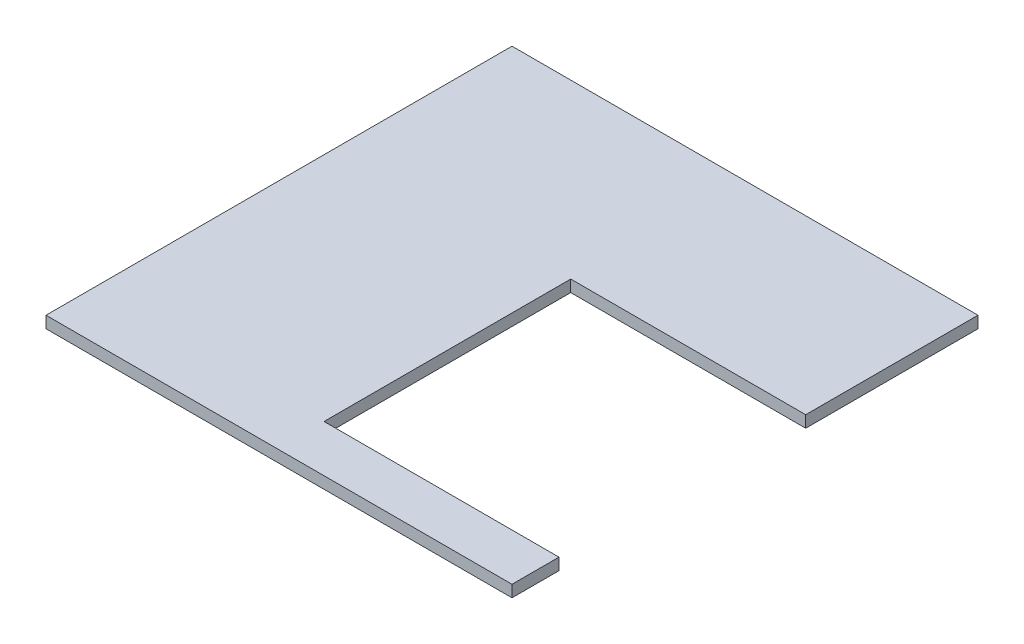
ISO-10303-21;
HEADER;
FILE_DESCRIPTION(('STEP AP214'),'2;1');
FILE_NAME('part.step','',(''),(''),'','','');
FILE_SCHEMA(('AUTOMOTIVE_DESIGN { 1 0 10303 214 1 1 1 1 }'));
ENDSEC;
DATA;
#1=APPLICATION_CONTEXT('core data for automotive mechanical design processes');
#2=APPLICATION_PROTOCOL_DEFINITION('international standard','automotive_design',2000,#1);
#3=PRODUCT_CONTEXT('',#1,'mechanical');
#4=PRODUCT('Part','Part','',(#3));
#5=PRODUCT_RELATED_PRODUCT_CATEGORY('part','',(#4));
#6=PRODUCT_DEFINITION_FORMATION('','',#4);
#7=PRODUCT_DEFINITION_CONTEXT('part definition',#1,'design');
#8=PRODUCT_DEFINITION('design','',#6,#7);
#9=PRODUCT_DEFINITION_SHAPE('','',#8);
#10=(LENGTH_UNIT() NAMED_UNIT(*) SI_UNIT(.MILLI.,.METRE.));
#11=(NAMED_UNIT(*) PLANE_ANGLE_UNIT() SI_UNIT($,.RADIAN.));
#12=(NAMED_UNIT(*) SI_UNIT($,.STERADIAN.) SOLID_ANGLE_UNIT());
#13=UNCERTAINTY_MEASURE_WITH_UNIT(LENGTH_MEASURE(1.E-05),#10,'distance_accuracy_value','');
#14=(GEOMETRIC_REPRESENTATION_CONTEXT(3) GLOBAL_UNCERTAINTY_ASSIGNED_CONTEXT((#13)) GLOBAL_UNIT_ASSIGNED_CONTEXT((#10,
#11,#12)) REPRESENTATION_CONTEXT('',''));
#15=CARTESIAN_POINT('',(0.,0.,0.));
#16=DIRECTION('',(0.,0.,1.));
#17=DIRECTION('',(1.,0.,0.));
#18=AXIS2_PLACEMENT_3D('',#15,#16,#17);
#19=CARTESIAN_POINT('',(0.,3.,-12.));
#20=DIRECTION('',(0.,0.,1.));
#21=DIRECTION('',(1.,0.,0.));
#22=AXIS2_PLACEMENT_3D('',#19,#20,#21);
#23=PLANE('',#22);
#24=DIRECTION('',(-1.,0.,0.));
#25=VECTOR('',#24,1.);
#26=CARTESIAN_POINT('',(0.,0.,-12.));
#27=LINE('',#26,#25);
#28=CARTESIAN_POINT('',(119.,0.,-12.));
#29=VERTEX_POINT('',#28);
#30=CARTESIAN_POINT('',(59.,0.,-12.));
#31=VERTEX_POINT('',#30);
#32=EDGE_CURVE('E130',#29,#31,#27,.T.);
#33=ORIENTED_EDGE('',*,*,#32,.T.);
#34=DIRECTION('',(0.,-1.,0.));
#35=VECTOR('',#34,1.);
#36=CARTESIAN_POINT('',(59.,3.,-12.));
#37=LINE('',#36,#35);
#38=CARTESIAN_POINT('',(59.,3.,-12.));
#39=VERTEX_POINT('',#38);
#40=EDGE_CURVE('E11',#39,#31,#37,.T.);
#41=ORIENTED_EDGE('',*,*,#40,.F.);
#42=DIRECTION('',(-1.,0.,0.));
#43=VECTOR('',#42,1.);
#44=CARTESIAN_POINT('',(0.,3.,-12.));
#45=LINE('',#44,#43);
#46=CARTESIAN_POINT('',(119.,3.,-12.));
#47=VERTEX_POINT('',#46);
#48=EDGE_CURVE('E172',#47,#39,#45,.T.);
#49=ORIENTED_EDGE('',*,*,#48,.F.);
#50=DIRECTION('',(0.,-1.,0.));
#51=VECTOR('',#50,1.);
#52=CARTESIAN_POINT('',(119.,3.,-12.));
#53=LINE('',#52,#51);
#54=EDGE_CURVE('E147',#47,#29,#53,.T.);
#55=ORIENTED_EDGE('',*,*,#54,.T.);
#56=EDGE_LOOP('',(#33,#41,#49,#55));
#57=FACE_BOUND('',#56,.T.);
#58=ADVANCED_FACE('F35',(#57),#23,.F.);
#59=CARTESIAN_POINT('',(59.,3.,0.));
#60=DIRECTION('',(-1.,0.,0.));
#61=DIRECTION('',(0.,0.,1.));
#62=AXIS2_PLACEMENT_3D('',#59,#60,#61);
#63=PLANE('',#62);
#64=DIRECTION('',(0.,0.,-1.));
#65=VECTOR('',#64,1.);
#66=CARTESIAN_POINT('',(59.,0.,0.));
#67=LINE('',#66,#65);
#68=CARTESIAN_POINT('',(59.,0.,-75.));
#69=VERTEX_POINT('',#68);
#70=EDGE_CURVE('E133',#31,#69,#67,.T.);
#71=ORIENTED_EDGE('',*,*,#70,.T.);
#72=DIRECTION('',(0.,-1.,0.));
#73=VECTOR('',#72,1.);
#74=CARTESIAN_POINT('',(59.,3.,-75.));
#75=LINE('',#74,#73);
#76=CARTESIAN_POINT('',(59.,3.,-75.));
#77=VERTEX_POINT('',#76);
#78=EDGE_CURVE('E43',#77,#69,#75,.T.);
#79=ORIENTED_EDGE('',*,*,#78,.F.);
#80=DIRECTION('',(0.,0.,-1.));
#81=VECTOR('',#80,1.);
#82=CARTESIAN_POINT('',(59.,3.,0.));
#83=LINE('',#82,#81);
#84=EDGE_CURVE('E93',#39,#77,#83,.T.);
#85=ORIENTED_EDGE('',*,*,#84,.F.);
#86=ORIENTED_EDGE('',*,*,#40,.T.);
#87=EDGE_LOOP('',(#71,#79,#85,#86));
#88=FACE_BOUND('',#87,.T.);
#89=ADVANCED_FACE('F160',(#88),#63,.F.);
#90=CARTESIAN_POINT('',(0.,3.,-75.));
#91=DIRECTION('',(0.,0.,1.));
#92=DIRECTION('',(1.,0.,0.));
#93=AXIS2_PLACEMENT_3D('',#90,#91,#92);
#94=PLANE('',#93);
#95=DIRECTION('',(-1.,0.,0.));
#96=VECTOR('',#95,1.);
#97=CARTESIAN_POINT('',(0.,0.,-75.));
#98=LINE('',#97,#96);
#99=CARTESIAN_POINT('',(119.,0.,-75.));
#100=VERTEX_POINT('',#99);
#101=EDGE_CURVE('E136',#100,#69,#98,.T.);
#102=ORIENTED_EDGE('',*,*,#101,.F.);
#103=DIRECTION('',(0.,-1.,0.));
#104=VECTOR('',#103,1.);
#105=CARTESIAN_POINT('',(119.,3.,-75.));
#106=LINE('',#105,#104);
#107=CARTESIAN_POINT('',(119.,3.,-75.));
#108=VERTEX_POINT('',#107);
#109=EDGE_CURVE('E153',#108,#100,#106,.T.);
#110=ORIENTED_EDGE('',*,*,#109,.F.);
#111=DIRECTION('',(-1.,0.,0.));
#112=VECTOR('',#111,1.);
#113=CARTESIAN_POINT('',(0.,3.,-75.));
#114=LINE('',#113,#112);
#115=EDGE_CURVE('E159',#108,#77,#114,.T.);
#116=ORIENTED_EDGE('',*,*,#115,.T.);
#117=ORIENTED_EDGE('',*,*,#78,.T.);
#118=EDGE_LOOP('',(#102,#110,#116,#117));
#119=FACE_BOUND('',#118,.T.);
#120=ADVANCED_FACE('F157',(#119),#94,.T.);
#121=CARTESIAN_POINT('',(119.,3.,0.));
#122=DIRECTION('',(-1.,0.,0.));
#123=DIRECTION('',(0.,0.,1.));
#124=AXIS2_PLACEMENT_3D('',#121,#122,#123);
#125=PLANE('',#124);
#126=DIRECTION('',(0.,0.,-1.));
#127=VECTOR('',#126,1.);
#128=CARTESIAN_POINT('',(119.,0.,0.));
#129=LINE('',#128,#127);
#130=CARTESIAN_POINT('',(119.,0.,-119.));
#131=VERTEX_POINT('',#130);
#132=EDGE_CURVE('E139',#100,#131,#129,.T.);
#133=ORIENTED_EDGE('',*,*,#132,.T.);
#134=DIRECTION('',(0.,-1.,0.));
#135=VECTOR('',#134,1.);
#136=CARTESIAN_POINT('',(119.,3.,-119.));
#137=LINE('',#136,#135);
#138=CARTESIAN_POINT('',(119.,3.,-119.));
#139=VERTEX_POINT('',#138);
#140=EDGE_CURVE('E151',#139,#131,#137,.T.);
#141=ORIENTED_EDGE('',*,*,#140,.F.);
#142=DIRECTION('',(0.,0.,-1.));
#143=VECTOR('',#142,1.);
#144=CARTESIAN_POINT('',(119.,3.,0.));
#145=LINE('',#144,#143);
#146=EDGE_CURVE('E126',#108,#139,#145,.T.);
#147=ORIENTED_EDGE('',*,*,#146,.F.);
#148=ORIENTED_EDGE('',*,*,#109,.T.);
#149=EDGE_LOOP('',(#133,#141,#147,#148));
#150=FACE_BOUND('',#149,.T.);
#151=ADVANCED_FACE('F169',(#150),#125,.F.);
#152=CARTESIAN_POINT('',(0.,3.,-119.));
#153=DIRECTION('',(0.,0.,-1.));
#154=DIRECTION('',(-1.,0.,0.));
#155=AXIS2_PLACEMENT_3D('',#152,#153,#154);
#156=PLANE('',#155);
#157=DIRECTION('',(1.,0.,0.));
#158=VECTOR('',#157,1.);
#159=CARTESIAN_POINT('',(0.,0.,-119.));
#160=LINE('',#159,#158);
#161=CARTESIAN_POINT('',(0.,0.,-119.));
#162=VERTEX_POINT('',#161);
#163=EDGE_CURVE('E142',#162,#131,#160,.T.);
#164=ORIENTED_EDGE('',*,*,#163,.F.);
#165=DIRECTION('',(0.,-1.,0.));
#166=VECTOR('',#165,1.);
#167=CARTESIAN_POINT('',(0.,3.,-119.));
#168=LINE('',#167,#166);
#169=CARTESIAN_POINT('',(0.,3.,-119.));
#170=VERTEX_POINT('',#169);
#171=EDGE_CURVE('E115',#170,#162,#168,.T.);
#172=ORIENTED_EDGE('',*,*,#171,.F.);
#173=DIRECTION('',(1.,0.,0.));
#174=VECTOR('',#173,1.);
#175=CARTESIAN_POINT('',(0.,3.,-119.));
#176=LINE('',#175,#174);
#177=EDGE_CURVE('E124',#170,#139,#176,.T.);
#178=ORIENTED_EDGE('',*,*,#177,.T.);
#179=ORIENTED_EDGE('',*,*,#140,.T.);
#180=EDGE_LOOP('',(#164,#172,#178,#179));
#181=FACE_BOUND('',#180,.T.);
#182=ADVANCED_FACE('F188',(#181),#156,.T.);
#183=CARTESIAN_POINT('',(0.,3.,0.));
#184=DIRECTION('',(-1.,0.,0.));
#185=DIRECTION('',(0.,0.,1.));
#186=AXIS2_PLACEMENT_3D('',#183,#184,#185);
#187=PLANE('',#186);
#188=DIRECTION('',(0.,0.,-1.));
#189=VECTOR('',#188,1.);
#190=CARTESIAN_POINT('',(0.,0.,0.));
#191=LINE('',#190,#189);
#192=CARTESIAN_POINT('',(0.,0.,0.));
#193=VERTEX_POINT('',#192);
#194=EDGE_CURVE('E114',#193,#162,#191,.T.);
#195=ORIENTED_EDGE('',*,*,#194,.F.);
#196=DIRECTION('',(0.,-1.,0.));
#197=VECTOR('',#196,1.);
#198=CARTESIAN_POINT('',(0.,3.,0.));
#199=LINE('',#198,#197);
#200=CARTESIAN_POINT('',(0.,3.,0.));
#201=VERTEX_POINT('',#200);
#202=EDGE_CURVE('E108',#201,#193,#199,.T.);
#203=ORIENTED_EDGE('',*,*,#202,.F.);
#204=DIRECTION('',(0.,0.,-1.));
#205=VECTOR('',#204,1.);
#206=CARTESIAN_POINT('',(0.,3.,0.));
#207=LINE('',#206,#205);
#208=EDGE_CURVE('E112',#201,#170,#207,.T.);
#209=ORIENTED_EDGE('',*,*,#208,.T.);
#210=ORIENTED_EDGE('',*,*,#171,.T.);
#211=EDGE_LOOP('',(#195,#203,#209,#210));
#212=FACE_BOUND('',#211,.T.);
#213=ADVANCED_FACE('F110',(#212),#187,.T.);
#214=CARTESIAN_POINT('',(0.,3.,0.));
#215=DIRECTION('',(0.,0.,-1.));
#216=DIRECTION('',(-1.,0.,0.));
#217=AXIS2_PLACEMENT_3D('',#214,#215,#216);
#218=PLANE('',#217);
#219=DIRECTION('',(1.,0.,0.));
#220=VECTOR('',#219,1.);
#221=CARTESIAN_POINT('',(0.,0.,0.));
#222=LINE('',#221,#220);
#223=CARTESIAN_POINT('',(119.,0.,0.));
#224=VERTEX_POINT('',#223);
#225=EDGE_CURVE('E79',#193,#224,#222,.T.);
#226=ORIENTED_EDGE('',*,*,#225,.T.);
#227=DIRECTION('',(0.,-1.,0.));
#228=VECTOR('',#227,1.);
#229=CARTESIAN_POINT('',(119.,3.,0.));
#230=LINE('',#229,#228);
#231=CARTESIAN_POINT('',(119.,3.,0.));
#232=VERTEX_POINT('',#231);
#233=EDGE_CURVE('E116',#232,#224,#230,.T.);
#234=ORIENTED_EDGE('',*,*,#233,.F.);
#235=DIRECTION('',(1.,0.,0.));
#236=VECTOR('',#235,1.);
#237=CARTESIAN_POINT('',(0.,3.,0.));
#238=LINE('',#237,#236);
#239=EDGE_CURVE('E118',#201,#232,#238,.T.);
#240=ORIENTED_EDGE('',*,*,#239,.F.);
#241=ORIENTED_EDGE('',*,*,#202,.T.);
#242=EDGE_LOOP('',(#226,#234,#240,#241));
#243=FACE_BOUND('',#242,.T.);
#244=ADVANCED_FACE('F119',(#243),#218,.F.);
#245=EDGE_CURVE('E85',#224,#29,#129,.T.);
#246=ORIENTED_EDGE('',*,*,#245,.T.);
#247=ORIENTED_EDGE('',*,*,#54,.F.);
#248=EDGE_CURVE('E51',#232,#47,#145,.T.);
#249=ORIENTED_EDGE('',*,*,#248,.F.);
#250=ORIENTED_EDGE('',*,*,#233,.T.);
#251=EDGE_LOOP('',(#246,#247,#249,#250));
#252=FACE_BOUND('',#251,.T.);
#253=ADVANCED_FACE('F177',(#252),#125,.F.);
#254=CARTESIAN_POINT('',(0.,3.,0.));
#255=DIRECTION('',(0.,1.,0.));
#256=DIRECTION('',(0.,0.,1.));
#257=AXIS2_PLACEMENT_3D('',#254,#255,#256);
#258=PLANE('',#257);
#259=ORIENTED_EDGE('',*,*,#48,.T.);
#260=ORIENTED_EDGE('',*,*,#84,.T.);
#261=ORIENTED_EDGE('',*,*,#115,.F.);
#262=ORIENTED_EDGE('',*,*,#146,.T.);
#263=ORIENTED_EDGE('',*,*,#177,.F.);
#264=ORIENTED_EDGE('',*,*,#208,.F.);
#265=ORIENTED_EDGE('',*,*,#239,.T.);
#266=ORIENTED_EDGE('',*,*,#248,.T.);
#267=EDGE_LOOP('',(#259,#260,#261,#262,#263,#264,#265,#266));
#268=FACE_BOUND('',#267,.T.);
#269=ADVANCED_FACE('F122',(#268),#258,.T.);
#270=CARTESIAN_POINT('',(0.,0.,0.));
#271=DIRECTION('',(0.,1.,0.));
#272=DIRECTION('',(0.,0.,1.));
#273=AXIS2_PLACEMENT_3D('',#270,#271,#272);
#274=PLANE('',#273);
#275=ORIENTED_EDGE('',*,*,#32,.F.);
#276=ORIENTED_EDGE('',*,*,#245,.F.);
#277=ORIENTED_EDGE('',*,*,#225,.F.);
#278=ORIENTED_EDGE('',*,*,#194,.T.);
#279=ORIENTED_EDGE('',*,*,#163,.T.);
#280=ORIENTED_EDGE('',*,*,#132,.F.);
#281=ORIENTED_EDGE('',*,*,#101,.T.);
#282=ORIENTED_EDGE('',*,*,#70,.F.);
#283=EDGE_LOOP('',(#275,#276,#277,#278,#279,#280,#281,#282));
#284=FACE_BOUND('',#283,.T.);
#285=ADVANCED_FACE('F165',(#284),#274,.F.);
#286=CLOSED_SHELL('',(#58,#89,#120,#151,#182,#213,#244,#253,#269,#285));
#287=MANIFOLD_SOLID_BREP('B2',#286);
#288=ADVANCED_BREP_SHAPE_REPRESENTATION('',(#18,#287),#14);
#289=SHAPE_DEFINITION_REPRESENTATION(#9,#288);
ENDSEC;
END-ISO-10303-21;
